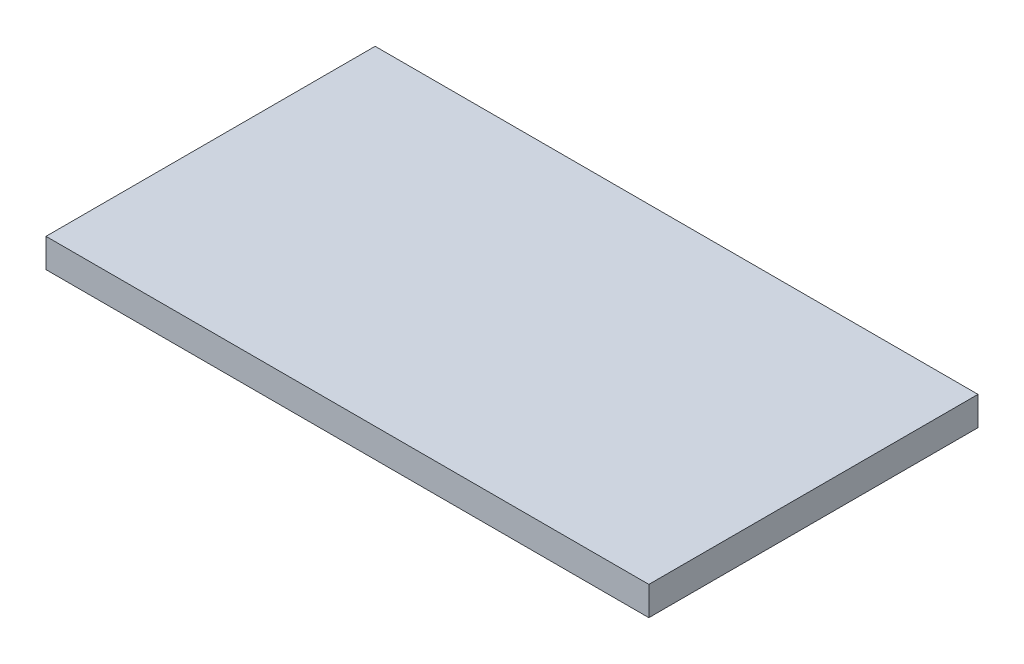
ISO-10303-21;
HEADER;
FILE_DESCRIPTION(('STEP AP214'),'2;1');
FILE_NAME('part.step','',(''),(''),'','','');
FILE_SCHEMA(('AUTOMOTIVE_DESIGN { 1 0 10303 214 1 1 1 1 }'));
ENDSEC;
DATA;
#1=APPLICATION_CONTEXT('core data for automotive mechanical design processes');
#2=APPLICATION_PROTOCOL_DEFINITION('international standard','automotive_design',2000,#1);
#3=PRODUCT_CONTEXT('',#1,'mechanical');
#4=PRODUCT('Part','Part','',(#3));
#5=PRODUCT_RELATED_PRODUCT_CATEGORY('part','',(#4));
#6=PRODUCT_DEFINITION_FORMATION('','',#4);
#7=PRODUCT_DEFINITION_CONTEXT('part definition',#1,'design');
#8=PRODUCT_DEFINITION('design','',#6,#7);
#9=PRODUCT_DEFINITION_SHAPE('','',#8);
#10=(LENGTH_UNIT() NAMED_UNIT(*) SI_UNIT(.MILLI.,.METRE.));
#11=(NAMED_UNIT(*) PLANE_ANGLE_UNIT() SI_UNIT($,.RADIAN.));
#12=(NAMED_UNIT(*) SI_UNIT($,.STERADIAN.) SOLID_ANGLE_UNIT());
#13=UNCERTAINTY_MEASURE_WITH_UNIT(LENGTH_MEASURE(1.E-05),#10,'distance_accuracy_value','');
#14=(GEOMETRIC_REPRESENTATION_CONTEXT(3) GLOBAL_UNCERTAINTY_ASSIGNED_CONTEXT((#13)) GLOBAL_UNIT_ASSIGNED_CONTEXT((#10,
#11,#12)) REPRESENTATION_CONTEXT('',''));
#15=CARTESIAN_POINT('',(0.,0.,0.));
#16=DIRECTION('',(0.,0.,1.));
#17=DIRECTION('',(1.,0.,0.));
#18=AXIS2_PLACEMENT_3D('',#15,#16,#17);
#19=CARTESIAN_POINT('',(0.,2.5,0.));
#20=DIRECTION('',(0.,-1.,0.));
#21=DIRECTION('',(0.,0.,-1.));
#22=AXIS2_PLACEMENT_3D('',#19,#20,#21);
#23=PLANE('',#22);
#24=DIRECTION('',(0.,0.,-1.));
#25=VECTOR('',#24,1.);
#26=CARTESIAN_POINT('',(26.1,2.5,11.7));
#27=LINE('',#26,#25);
#28=CARTESIAN_POINT('',(26.1,2.5,11.7));
#29=VERTEX_POINT('',#28);
#30=CARTESIAN_POINT('',(26.1,2.5,-16.8));
#31=VERTEX_POINT('',#30);
#32=EDGE_CURVE('E85',#29,#31,#27,.T.);
#33=ORIENTED_EDGE('',*,*,#32,.T.);
#34=DIRECTION('',(-1.,0.,0.));
#35=VECTOR('',#34,1.);
#36=CARTESIAN_POINT('',(-26.1,2.5,-16.8));
#37=LINE('',#36,#35);
#38=CARTESIAN_POINT('',(-26.1,2.5,-16.8));
#39=VERTEX_POINT('',#38);
#40=EDGE_CURVE('E81',#31,#39,#37,.T.);
#41=ORIENTED_EDGE('',*,*,#40,.T.);
#42=DIRECTION('',(0.,0.,1.));
#43=VECTOR('',#42,1.);
#44=CARTESIAN_POINT('',(-26.1,2.5,11.7));
#45=LINE('',#44,#43);
#46=CARTESIAN_POINT('',(-26.1,2.5,11.7));
#47=VERTEX_POINT('',#46);
#48=EDGE_CURVE('E83',#39,#47,#45,.T.);
#49=ORIENTED_EDGE('',*,*,#48,.T.);
#50=DIRECTION('',(1.,0.,0.));
#51=VECTOR('',#50,1.);
#52=CARTESIAN_POINT('',(-26.1,2.5,11.7));
#53=LINE('',#52,#51);
#54=EDGE_CURVE('E51',#47,#29,#53,.T.);
#55=ORIENTED_EDGE('',*,*,#54,.T.);
#56=EDGE_LOOP('',(#33,#41,#49,#55));
#57=FACE_BOUND('',#56,.T.);
#58=ADVANCED_FACE('F34',(#57),#23,.F.);
#59=CARTESIAN_POINT('',(0.,0.,0.));
#60=DIRECTION('',(0.,-1.,0.));
#61=DIRECTION('',(0.,0.,-1.));
#62=AXIS2_PLACEMENT_3D('',#59,#60,#61);
#63=PLANE('',#62);
#64=DIRECTION('',(0.,0.,-1.));
#65=VECTOR('',#64,1.);
#66=CARTESIAN_POINT('',(26.1,0.,11.7));
#67=LINE('',#66,#65);
#68=CARTESIAN_POINT('',(26.1,0.,11.7));
#69=VERTEX_POINT('',#68);
#70=CARTESIAN_POINT('',(26.1,0.,-16.8));
#71=VERTEX_POINT('',#70);
#72=EDGE_CURVE('E97',#69,#71,#67,.T.);
#73=ORIENTED_EDGE('',*,*,#72,.F.);
#74=DIRECTION('',(1.,0.,0.));
#75=VECTOR('',#74,1.);
#76=CARTESIAN_POINT('',(-26.1,0.,11.7));
#77=LINE('',#76,#75);
#78=CARTESIAN_POINT('',(-26.1,0.,11.7));
#79=VERTEX_POINT('',#78);
#80=EDGE_CURVE('E74',#79,#69,#77,.T.);
#81=ORIENTED_EDGE('',*,*,#80,.F.);
#82=DIRECTION('',(0.,0.,1.));
#83=VECTOR('',#82,1.);
#84=CARTESIAN_POINT('',(-26.1,0.,11.7));
#85=LINE('',#84,#83);
#86=CARTESIAN_POINT('',(-26.1,0.,-16.8));
#87=VERTEX_POINT('',#86);
#88=EDGE_CURVE('E68',#87,#79,#85,.T.);
#89=ORIENTED_EDGE('',*,*,#88,.F.);
#90=DIRECTION('',(-1.,0.,0.));
#91=VECTOR('',#90,1.);
#92=CARTESIAN_POINT('',(-26.1,0.,-16.8));
#93=LINE('',#92,#91);
#94=EDGE_CURVE('E89',#71,#87,#93,.T.);
#95=ORIENTED_EDGE('',*,*,#94,.F.);
#96=EDGE_LOOP('',(#73,#81,#89,#95));
#97=FACE_BOUND('',#96,.T.);
#98=ADVANCED_FACE('F107',(#97),#63,.T.);
#99=CARTESIAN_POINT('',(26.1,2.5,11.7));
#100=DIRECTION('',(-1.,0.,0.));
#101=DIRECTION('',(0.,0.,1.));
#102=AXIS2_PLACEMENT_3D('',#99,#100,#101);
#103=PLANE('',#102);
#104=ORIENTED_EDGE('',*,*,#72,.T.);
#105=DIRECTION('',(0.,-1.,0.));
#106=VECTOR('',#105,1.);
#107=CARTESIAN_POINT('',(26.1,2.5,-16.8));
#108=LINE('',#107,#106);
#109=EDGE_CURVE('E11',#31,#71,#108,.T.);
#110=ORIENTED_EDGE('',*,*,#109,.F.);
#111=ORIENTED_EDGE('',*,*,#32,.F.);
#112=DIRECTION('',(0.,-1.,0.));
#113=VECTOR('',#112,1.);
#114=CARTESIAN_POINT('',(26.1,2.5,11.7));
#115=LINE('',#114,#113);
#116=EDGE_CURVE('E93',#29,#69,#115,.T.);
#117=ORIENTED_EDGE('',*,*,#116,.T.);
#118=EDGE_LOOP('',(#104,#110,#111,#117));
#119=FACE_BOUND('',#118,.T.);
#120=ADVANCED_FACE('F36',(#119),#103,.F.);
#121=CARTESIAN_POINT('',(-26.1,2.5,-16.8));
#122=DIRECTION('',(0.,0.,1.));
#123=DIRECTION('',(1.,0.,0.));
#124=AXIS2_PLACEMENT_3D('',#121,#122,#123);
#125=PLANE('',#124);
#126=ORIENTED_EDGE('',*,*,#94,.T.);
#127=DIRECTION('',(0.,-1.,0.));
#128=VECTOR('',#127,1.);
#129=CARTESIAN_POINT('',(-26.1,2.5,-16.8));
#130=LINE('',#129,#128);
#131=EDGE_CURVE('E43',#39,#87,#130,.T.);
#132=ORIENTED_EDGE('',*,*,#131,.F.);
#133=ORIENTED_EDGE('',*,*,#40,.F.);
#134=ORIENTED_EDGE('',*,*,#109,.T.);
#135=EDGE_LOOP('',(#126,#132,#133,#134));
#136=FACE_BOUND('',#135,.T.);
#137=ADVANCED_FACE('F88',(#136),#125,.F.);
#138=CARTESIAN_POINT('',(-26.1,2.5,11.7));
#139=DIRECTION('',(1.,0.,0.));
#140=DIRECTION('',(0.,0.,-1.));
#141=AXIS2_PLACEMENT_3D('',#138,#139,#140);
#142=PLANE('',#141);
#143=ORIENTED_EDGE('',*,*,#88,.T.);
#144=DIRECTION('',(0.,-1.,0.));
#145=VECTOR('',#144,1.);
#146=CARTESIAN_POINT('',(-26.1,2.5,11.7));
#147=LINE('',#146,#145);
#148=EDGE_CURVE('E90',#47,#79,#147,.T.);
#149=ORIENTED_EDGE('',*,*,#148,.F.);
#150=ORIENTED_EDGE('',*,*,#48,.F.);
#151=ORIENTED_EDGE('',*,*,#131,.T.);
#152=EDGE_LOOP('',(#143,#149,#150,#151));
#153=FACE_BOUND('',#152,.T.);
#154=ADVANCED_FACE('F91',(#153),#142,.F.);
#155=CARTESIAN_POINT('',(-26.1,2.5,11.7));
#156=DIRECTION('',(0.,0.,-1.));
#157=DIRECTION('',(-1.,0.,0.));
#158=AXIS2_PLACEMENT_3D('',#155,#156,#157);
#159=PLANE('',#158);
#160=ORIENTED_EDGE('',*,*,#80,.T.);
#161=ORIENTED_EDGE('',*,*,#116,.F.);
#162=ORIENTED_EDGE('',*,*,#54,.F.);
#163=ORIENTED_EDGE('',*,*,#148,.T.);
#164=EDGE_LOOP('',(#160,#161,#162,#163));
#165=FACE_BOUND('',#164,.T.);
#166=ADVANCED_FACE('F104',(#165),#159,.F.);
#167=CLOSED_SHELL('',(#58,#98,#120,#137,#154,#166));
#168=MANIFOLD_SOLID_BREP('B2',#167);
#169=ADVANCED_BREP_SHAPE_REPRESENTATION('',(#18,#168),#14);
#170=SHAPE_DEFINITION_REPRESENTATION(#9,#169);
ENDSEC;
END-ISO-10303-21;
